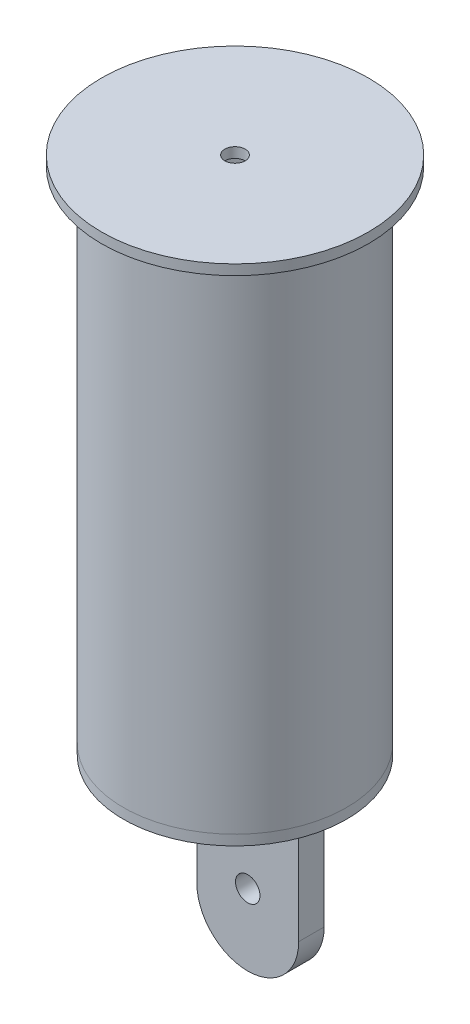
ISO-10303-21;
HEADER;
FILE_DESCRIPTION(('STEP AP214'),'2;1');
FILE_NAME('part.step','',(''),(''),'','','');
FILE_SCHEMA(('AUTOMOTIVE_DESIGN { 1 0 10303 214 1 1 1 1 }'));
ENDSEC;
DATA;
#1=APPLICATION_CONTEXT('core data for automotive mechanical design processes');
#2=APPLICATION_PROTOCOL_DEFINITION('international standard','automotive_design',2000,#1);
#3=PRODUCT_CONTEXT('',#1,'mechanical');
#4=PRODUCT('Part','Part','',(#3));
#5=PRODUCT_RELATED_PRODUCT_CATEGORY('part','',(#4));
#6=PRODUCT_DEFINITION_FORMATION('','',#4);
#7=PRODUCT_DEFINITION_CONTEXT('part definition',#1,'design');
#8=PRODUCT_DEFINITION('design','',#6,#7);
#9=PRODUCT_DEFINITION_SHAPE('','',#8);
#10=(LENGTH_UNIT() NAMED_UNIT(*) SI_UNIT(.MILLI.,.METRE.));
#11=(NAMED_UNIT(*) PLANE_ANGLE_UNIT() SI_UNIT($,.RADIAN.));
#12=(NAMED_UNIT(*) SI_UNIT($,.STERADIAN.) SOLID_ANGLE_UNIT());
#13=UNCERTAINTY_MEASURE_WITH_UNIT(LENGTH_MEASURE(1.E-05),#10,'distance_accuracy_value','');
#14=(GEOMETRIC_REPRESENTATION_CONTEXT(3) GLOBAL_UNCERTAINTY_ASSIGNED_CONTEXT((#13)) GLOBAL_UNIT_ASSIGNED_CONTEXT((#10,
#11,#12)) REPRESENTATION_CONTEXT('',''));
#15=CARTESIAN_POINT('',(0.,0.,0.));
#16=DIRECTION('',(0.,0.,1.));
#17=DIRECTION('',(1.,0.,0.));
#18=AXIS2_PLACEMENT_3D('',#15,#16,#17);
#19=CARTESIAN_POINT('',(0.,-10.,0.));
#20=DIRECTION('',(0.,-1.,0.));
#21=DIRECTION('',(0.,0.,-1.));
#22=AXIS2_PLACEMENT_3D('',#19,#20,#21);
#23=PLANE('',#22);
#24=CARTESIAN_POINT('',(0.,-10.,0.));
#25=DIRECTION('',(0.,-1.,0.));
#26=DIRECTION('',(0.,0.,-1.));
#27=AXIS2_PLACEMENT_3D('',#24,#25,#26);
#28=CIRCLE('',#27,109.54);
#29=CARTESIAN_POINT('',(0.,-10.,-109.54));
#30=VERTEX_POINT('',#29);
#31=EDGE_CURVE('E14',#30,#30,#28,.T.);
#32=ORIENTED_EDGE('',*,*,#31,.T.);
#33=EDGE_LOOP('',(#32));
#34=FACE_BOUND('',#33,.T.);
#35=DIRECTION('',(0.,0.,1.));
#36=VECTOR('',#35,1.);
#37=CARTESIAN_POINT('',(50.,-10.,-37.5));
#38=LINE('',#37,#36);
#39=CARTESIAN_POINT('',(50.,-10.,-37.5));
#40=VERTEX_POINT('',#39);
#41=CARTESIAN_POINT('',(50.,-10.,-12.5));
#42=VERTEX_POINT('',#41);
#43=EDGE_CURVE('E71',#40,#42,#38,.T.);
#44=ORIENTED_EDGE('',*,*,#43,.F.);
#45=DIRECTION('',(-1.,0.,0.));
#46=VECTOR('',#45,1.);
#47=CARTESIAN_POINT('',(-50.,-10.,-37.5));
#48=LINE('',#47,#46);
#49=CARTESIAN_POINT('',(-50.,-10.,-37.5));
#50=VERTEX_POINT('',#49);
#51=EDGE_CURVE('E75',#40,#50,#48,.T.);
#52=ORIENTED_EDGE('',*,*,#51,.T.);
#53=DIRECTION('',(0.,0.,1.));
#54=VECTOR('',#53,1.);
#55=CARTESIAN_POINT('',(-50.,-10.,-37.5));
#56=LINE('',#55,#54);
#57=CARTESIAN_POINT('',(-50.,-10.,-12.5));
#58=VERTEX_POINT('',#57);
#59=EDGE_CURVE('E107',#50,#58,#56,.T.);
#60=ORIENTED_EDGE('',*,*,#59,.T.);
#61=DIRECTION('',(-1.,0.,0.));
#62=VECTOR('',#61,1.);
#63=CARTESIAN_POINT('',(-50.,-10.,-12.5));
#64=LINE('',#63,#62);
#65=EDGE_CURVE('E123',#42,#58,#64,.T.);
#66=ORIENTED_EDGE('',*,*,#65,.F.);
#67=EDGE_LOOP('',(#44,#52,#60,#66));
#68=FACE_BOUND('',#67,.T.);
#69=ADVANCED_FACE('F56',(#34,#68),#23,.T.);
#70=CARTESIAN_POINT('',(0.,-10.,0.));
#71=DIRECTION('',(0.,1.,0.));
#72=DIRECTION('',(0.,0.,1.));
#73=AXIS2_PLACEMENT_3D('',#70,#71,#72);
#74=CYLINDRICAL_SURFACE('',#73,109.54);
#75=ORIENTED_EDGE('',*,*,#31,.F.);
#76=EDGE_LOOP('',(#75));
#77=FACE_BOUND('',#76,.T.);
#78=CARTESIAN_POINT('',(0.,0.,0.));
#79=DIRECTION('',(0.,-1.,0.));
#80=DIRECTION('',(0.,0.,-1.));
#81=AXIS2_PLACEMENT_3D('',#78,#79,#80);
#82=CIRCLE('',#81,109.54);
#83=CARTESIAN_POINT('',(0.,0.,-109.54));
#84=VERTEX_POINT('',#83);
#85=EDGE_CURVE('E60',#84,#84,#82,.T.);
#86=ORIENTED_EDGE('',*,*,#85,.T.);
#87=EDGE_LOOP('',(#86));
#88=FACE_BOUND('',#87,.T.);
#89=ADVANCED_FACE('F58',(#77,#88),#74,.T.);
#90=CARTESIAN_POINT('',(0.,0.,0.));
#91=DIRECTION('',(0.,-1.,0.));
#92=DIRECTION('',(0.,0.,-1.));
#93=AXIS2_PLACEMENT_3D('',#90,#91,#92);
#94=PLANE('',#93);
#95=ORIENTED_EDGE('',*,*,#85,.F.);
#96=EDGE_LOOP('',(#95));
#97=FACE_BOUND('',#96,.T.);
#98=ADVANCED_FACE('F140',(#97),#94,.F.);
#99=CARTESIAN_POINT('',(50.,-10.,-37.5));
#100=DIRECTION('',(1.,0.,0.));
#101=DIRECTION('',(0.,1.,0.));
#102=AXIS2_PLACEMENT_3D('',#99,#100,#101);
#103=PLANE('',#102);
#104=DIRECTION('',(0.,1.,0.));
#105=VECTOR('',#104,1.);
#106=CARTESIAN_POINT('',(50.,-10.,-12.5));
#107=LINE('',#106,#105);
#108=CARTESIAN_POINT('',(50.,-150.,-12.5));
#109=VERTEX_POINT('',#108);
#110=EDGE_CURVE('E118',#109,#42,#107,.T.);
#111=ORIENTED_EDGE('',*,*,#110,.F.);
#112=DIRECTION('',(0.,0.,1.));
#113=VECTOR('',#112,1.);
#114=CARTESIAN_POINT('',(50.,-150.,-37.5));
#115=LINE('',#114,#113);
#116=CARTESIAN_POINT('',(50.,-150.,-37.5));
#117=VERTEX_POINT('',#116);
#118=EDGE_CURVE('E106',#117,#109,#115,.T.);
#119=ORIENTED_EDGE('',*,*,#118,.F.);
#120=DIRECTION('',(0.,1.,0.));
#121=VECTOR('',#120,1.);
#122=CARTESIAN_POINT('',(50.,-10.,-37.5));
#123=LINE('',#122,#121);
#124=EDGE_CURVE('E114',#117,#40,#123,.T.);
#125=ORIENTED_EDGE('',*,*,#124,.T.);
#126=ORIENTED_EDGE('',*,*,#43,.T.);
#127=EDGE_LOOP('',(#111,#119,#125,#126));
#128=FACE_BOUND('',#127,.T.);
#129=ADVANCED_FACE('F138',(#128),#103,.T.);
#130=CARTESIAN_POINT('',(0.,-150.,-37.5));
#131=DIRECTION('',(0.,0.,1.));
#132=DIRECTION('',(1.,0.,0.));
#133=AXIS2_PLACEMENT_3D('',#130,#131,#132);
#134=CYLINDRICAL_SURFACE('',#133,50.);
#135=CARTESIAN_POINT('',(0.,-150.,-12.5));
#136=DIRECTION('',(0.,0.,1.));
#137=DIRECTION('',(1.,0.,0.));
#138=AXIS2_PLACEMENT_3D('',#135,#136,#137);
#139=CIRCLE('',#138,50.);
#140=CARTESIAN_POINT('',(-50.,-150.,-12.5));
#141=VERTEX_POINT('',#140);
#142=EDGE_CURVE('E101',#141,#109,#139,.T.);
#143=ORIENTED_EDGE('',*,*,#142,.F.);
#144=DIRECTION('',(0.,0.,1.));
#145=VECTOR('',#144,1.);
#146=CARTESIAN_POINT('',(-50.,-150.,-37.5));
#147=LINE('',#146,#145);
#148=CARTESIAN_POINT('',(-50.,-150.,-37.5));
#149=VERTEX_POINT('',#148);
#150=EDGE_CURVE('E95',#149,#141,#147,.T.);
#151=ORIENTED_EDGE('',*,*,#150,.F.);
#152=CARTESIAN_POINT('',(0.,-150.,-37.5));
#153=DIRECTION('',(0.,0.,1.));
#154=DIRECTION('',(1.,0.,0.));
#155=AXIS2_PLACEMENT_3D('',#152,#153,#154);
#156=CIRCLE('',#155,50.);
#157=EDGE_CURVE('E98',#149,#117,#156,.T.);
#158=ORIENTED_EDGE('',*,*,#157,.T.);
#159=ORIENTED_EDGE('',*,*,#118,.T.);
#160=EDGE_LOOP('',(#143,#151,#158,#159));
#161=FACE_BOUND('',#160,.T.);
#162=ADVANCED_FACE('F97',(#161),#134,.T.);
#163=CARTESIAN_POINT('',(-50.,-10.,-37.5));
#164=DIRECTION('',(-1.,0.,0.));
#165=DIRECTION('',(0.,-1.,0.));
#166=AXIS2_PLACEMENT_3D('',#163,#164,#165);
#167=PLANE('',#166);
#168=DIRECTION('',(0.,-1.,0.));
#169=VECTOR('',#168,1.);
#170=CARTESIAN_POINT('',(-50.,-10.,-12.5));
#171=LINE('',#170,#169);
#172=EDGE_CURVE('E126',#58,#141,#171,.T.);
#173=ORIENTED_EDGE('',*,*,#172,.F.);
#174=ORIENTED_EDGE('',*,*,#59,.F.);
#175=DIRECTION('',(0.,-1.,0.));
#176=VECTOR('',#175,1.);
#177=CARTESIAN_POINT('',(-50.,-10.,-37.5));
#178=LINE('',#177,#176);
#179=EDGE_CURVE('E112',#50,#149,#178,.T.);
#180=ORIENTED_EDGE('',*,*,#179,.T.);
#181=ORIENTED_EDGE('',*,*,#150,.T.);
#182=EDGE_LOOP('',(#173,#174,#180,#181));
#183=FACE_BOUND('',#182,.T.);
#184=ADVANCED_FACE('F116',(#183),#167,.T.);
#185=CARTESIAN_POINT('',(0.,-150.,-37.5));
#186=DIRECTION('',(0.,0.,1.));
#187=DIRECTION('',(1.,0.,0.));
#188=AXIS2_PLACEMENT_3D('',#185,#186,#187);
#189=PLANE('',#188);
#190=CARTESIAN_POINT('',(0.,-130.,-37.5));
#191=DIRECTION('',(0.,0.,1.));
#192=DIRECTION('',(1.,0.,0.));
#193=AXIS2_PLACEMENT_3D('',#190,#191,#192);
#194=CIRCLE('',#193,12.);
#195=CARTESIAN_POINT('',(12.,-130.,-37.5));
#196=VERTEX_POINT('',#195);
#197=EDGE_CURVE('E127',#196,#196,#194,.T.);
#198=ORIENTED_EDGE('',*,*,#197,.T.);
#199=EDGE_LOOP('',(#198));
#200=FACE_BOUND('',#199,.T.);
#201=ORIENTED_EDGE('',*,*,#51,.F.);
#202=ORIENTED_EDGE('',*,*,#124,.F.);
#203=ORIENTED_EDGE('',*,*,#157,.F.);
#204=ORIENTED_EDGE('',*,*,#179,.F.);
#205=EDGE_LOOP('',(#201,#202,#203,#204));
#206=FACE_BOUND('',#205,.T.);
#207=ADVANCED_FACE('F111',(#200,#206),#189,.F.);
#208=CARTESIAN_POINT('',(0.,-150.,-12.5));
#209=DIRECTION('',(0.,0.,1.));
#210=DIRECTION('',(1.,0.,0.));
#211=AXIS2_PLACEMENT_3D('',#208,#209,#210);
#212=PLANE('',#211);
#213=CARTESIAN_POINT('',(0.,-130.,-12.5));
#214=DIRECTION('',(0.,0.,1.));
#215=DIRECTION('',(1.,0.,0.));
#216=AXIS2_PLACEMENT_3D('',#213,#214,#215);
#217=CIRCLE('',#216,12.);
#218=CARTESIAN_POINT('',(12.,-130.,-12.5));
#219=VERTEX_POINT('',#218);
#220=EDGE_CURVE('E178',#219,#219,#217,.T.);
#221=ORIENTED_EDGE('',*,*,#220,.F.);
#222=EDGE_LOOP('',(#221));
#223=FACE_BOUND('',#222,.T.);
#224=ORIENTED_EDGE('',*,*,#65,.T.);
#225=ORIENTED_EDGE('',*,*,#172,.T.);
#226=ORIENTED_EDGE('',*,*,#142,.T.);
#227=ORIENTED_EDGE('',*,*,#110,.T.);
#228=EDGE_LOOP('',(#224,#225,#226,#227));
#229=FACE_BOUND('',#228,.T.);
#230=ADVANCED_FACE('F135',(#223,#229),#212,.T.);
#231=CARTESIAN_POINT('',(0.,-130.,-37.5));
#232=DIRECTION('',(0.,0.,1.));
#233=DIRECTION('',(1.,0.,0.));
#234=AXIS2_PLACEMENT_3D('',#231,#232,#233);
#235=CYLINDRICAL_SURFACE('',#234,12.);
#236=ORIENTED_EDGE('',*,*,#197,.F.);
#237=EDGE_LOOP('',(#236));
#238=FACE_BOUND('',#237,.T.);
#239=ORIENTED_EDGE('',*,*,#220,.T.);
#240=EDGE_LOOP('',(#239));
#241=FACE_BOUND('',#240,.T.);
#242=ADVANCED_FACE('F166',(#238,#241),#235,.F.);
#243=CLOSED_SHELL('',(#69,#89,#98,#129,#162,#184,#207,#230,#242));
#244=MANIFOLD_SOLID_BREP('B2',#243);
#245=CARTESIAN_POINT('',(0.,0.,0.));
#246=DIRECTION('',(0.,-1.,0.));
#247=DIRECTION('',(0.,0.,-1.));
#248=AXIS2_PLACEMENT_3D('',#245,#246,#247);
#249=CYLINDRICAL_SURFACE('',#248,10.);
#250=CARTESIAN_POINT('',(0.,490.,0.));
#251=DIRECTION('',(0.,-1.,0.));
#252=DIRECTION('',(0.,0.,-1.));
#253=AXIS2_PLACEMENT_3D('',#250,#251,#252);
#254=CIRCLE('',#253,10.);
#255=CARTESIAN_POINT('',(0.,490.,-10.));
#256=VERTEX_POINT('',#255);
#257=EDGE_CURVE('E246',#256,#256,#254,.T.);
#258=ORIENTED_EDGE('',*,*,#257,.T.);
#259=EDGE_LOOP('',(#258));
#260=FACE_BOUND('',#259,.T.);
#261=CARTESIAN_POINT('',(0.,500.,0.));
#262=DIRECTION('',(0.,-1.,0.));
#263=DIRECTION('',(0.,0.,-1.));
#264=AXIS2_PLACEMENT_3D('',#261,#262,#263);
#265=CIRCLE('',#264,10.);
#266=CARTESIAN_POINT('',(0.,500.,-10.));
#267=VERTEX_POINT('',#266);
#268=EDGE_CURVE('E55',#267,#267,#265,.T.);
#269=ORIENTED_EDGE('',*,*,#268,.F.);
#270=EDGE_LOOP('',(#269));
#271=FACE_BOUND('',#270,.T.);
#272=ADVANCED_FACE('F218',(#260,#271),#249,.F.);
#273=CARTESIAN_POINT('',(10.,500.,0.));
#274=DIRECTION('',(0.,1.,0.));
#275=DIRECTION('',(0.,0.,1.));
#276=AXIS2_PLACEMENT_3D('',#273,#274,#275);
#277=PLANE('',#276);
#278=ORIENTED_EDGE('',*,*,#268,.T.);
#279=EDGE_LOOP('',(#278));
#280=FACE_BOUND('',#279,.T.);
#281=CARTESIAN_POINT('',(0.,500.,0.));
#282=DIRECTION('',(0.,-1.,0.));
#283=DIRECTION('',(0.,0.,-1.));
#284=AXIS2_PLACEMENT_3D('',#281,#282,#283);
#285=CIRCLE('',#284,131.);
#286=CARTESIAN_POINT('',(0.,500.,-131.));
#287=VERTEX_POINT('',#286);
#288=EDGE_CURVE('E224',#287,#287,#285,.T.);
#289=ORIENTED_EDGE('',*,*,#288,.F.);
#290=EDGE_LOOP('',(#289));
#291=FACE_BOUND('',#290,.T.);
#292=ADVANCED_FACE('F264',(#280,#291),#277,.T.);
#293=CARTESIAN_POINT('',(0.,0.,0.));
#294=DIRECTION('',(0.,-1.,0.));
#295=DIRECTION('',(0.,0.,-1.));
#296=AXIS2_PLACEMENT_3D('',#293,#294,#295);
#297=CYLINDRICAL_SURFACE('',#296,131.);
#298=ORIENTED_EDGE('',*,*,#288,.T.);
#299=EDGE_LOOP('',(#298));
#300=FACE_BOUND('',#299,.T.);
#301=CARTESIAN_POINT('',(0.,490.,0.));
#302=DIRECTION('',(0.,-1.,0.));
#303=DIRECTION('',(0.,0.,-1.));
#304=AXIS2_PLACEMENT_3D('',#301,#302,#303);
#305=CIRCLE('',#304,131.);
#306=CARTESIAN_POINT('',(0.,490.,-131.));
#307=VERTEX_POINT('',#306);
#308=EDGE_CURVE('E228',#307,#307,#305,.T.);
#309=ORIENTED_EDGE('',*,*,#308,.F.);
#310=EDGE_LOOP('',(#309));
#311=FACE_BOUND('',#310,.T.);
#312=ADVANCED_FACE('F268',(#300,#311),#297,.T.);
#313=CARTESIAN_POINT('',(131.,490.,0.));
#314=DIRECTION('',(0.,-1.,0.));
#315=DIRECTION('',(0.,0.,-1.));
#316=AXIS2_PLACEMENT_3D('',#313,#314,#315);
#317=PLANE('',#316);
#318=ORIENTED_EDGE('',*,*,#308,.T.);
#319=EDGE_LOOP('',(#318));
#320=FACE_BOUND('',#319,.T.);
#321=CARTESIAN_POINT('',(0.,490.,0.));
#322=DIRECTION('',(0.,-1.,0.));
#323=DIRECTION('',(0.,0.,-1.));
#324=AXIS2_PLACEMENT_3D('',#321,#322,#323);
#325=CIRCLE('',#324,109.54);
#326=CARTESIAN_POINT('',(0.,490.,-109.54));
#327=VERTEX_POINT('',#326);
#328=EDGE_CURVE('E232',#327,#327,#325,.T.);
#329=ORIENTED_EDGE('',*,*,#328,.F.);
#330=EDGE_LOOP('',(#329));
#331=FACE_BOUND('',#330,.T.);
#332=ADVANCED_FACE('F272',(#320,#331),#317,.T.);
#333=CARTESIAN_POINT('',(0.,0.,0.));
#334=DIRECTION('',(0.,-1.,0.));
#335=DIRECTION('',(0.,0.,-1.));
#336=AXIS2_PLACEMENT_3D('',#333,#334,#335);
#337=CYLINDRICAL_SURFACE('',#336,109.54);
#338=ORIENTED_EDGE('',*,*,#328,.T.);
#339=EDGE_LOOP('',(#338));
#340=FACE_BOUND('',#339,.T.);
#341=CARTESIAN_POINT('',(0.,0.,0.));
#342=DIRECTION('',(0.,-1.,0.));
#343=DIRECTION('',(0.,0.,-1.));
#344=AXIS2_PLACEMENT_3D('',#341,#342,#343);
#345=CIRCLE('',#344,109.54);
#346=CARTESIAN_POINT('',(0.,0.,-109.54));
#347=VERTEX_POINT('',#346);
#348=EDGE_CURVE('E237',#347,#347,#345,.T.);
#349=ORIENTED_EDGE('',*,*,#348,.F.);
#350=EDGE_LOOP('',(#349));
#351=FACE_BOUND('',#350,.T.);
#352=ADVANCED_FACE('F278',(#340,#351),#337,.T.);
#353=CARTESIAN_POINT('',(103.54,0.,0.));
#354=DIRECTION('',(0.,-1.,0.));
#355=DIRECTION('',(0.,0.,-1.));
#356=AXIS2_PLACEMENT_3D('',#353,#354,#355);
#357=PLANE('',#356);
#358=ORIENTED_EDGE('',*,*,#348,.T.);
#359=EDGE_LOOP('',(#358));
#360=FACE_BOUND('',#359,.T.);
#361=CARTESIAN_POINT('',(0.,0.,0.));
#362=DIRECTION('',(0.,-1.,0.));
#363=DIRECTION('',(0.,0.,-1.));
#364=AXIS2_PLACEMENT_3D('',#361,#362,#363);
#365=CIRCLE('',#364,103.54);
#366=CARTESIAN_POINT('',(0.,0.,-103.54));
#367=VERTEX_POINT('',#366);
#368=EDGE_CURVE('E240',#367,#367,#365,.T.);
#369=ORIENTED_EDGE('',*,*,#368,.F.);
#370=EDGE_LOOP('',(#369));
#371=FACE_BOUND('',#370,.T.);
#372=ADVANCED_FACE('F260',(#360,#371),#357,.T.);
#373=CARTESIAN_POINT('',(0.,0.,0.));
#374=DIRECTION('',(0.,-1.,0.));
#375=DIRECTION('',(0.,0.,-1.));
#376=AXIS2_PLACEMENT_3D('',#373,#374,#375);
#377=CYLINDRICAL_SURFACE('',#376,103.54);
#378=ORIENTED_EDGE('',*,*,#368,.T.);
#379=EDGE_LOOP('',(#378));
#380=FACE_BOUND('',#379,.T.);
#381=CARTESIAN_POINT('',(0.,490.,0.));
#382=DIRECTION('',(0.,-1.,0.));
#383=DIRECTION('',(0.,0.,-1.));
#384=AXIS2_PLACEMENT_3D('',#381,#382,#383);
#385=CIRCLE('',#384,103.54);
#386=CARTESIAN_POINT('',(0.,490.,-103.54));
#387=VERTEX_POINT('',#386);
#388=EDGE_CURVE('E243',#387,#387,#385,.T.);
#389=ORIENTED_EDGE('',*,*,#388,.F.);
#390=EDGE_LOOP('',(#389));
#391=FACE_BOUND('',#390,.T.);
#392=ADVANCED_FACE('F254',(#380,#391),#377,.F.);
#393=CARTESIAN_POINT('',(103.54,490.,0.));
#394=DIRECTION('',(0.,-1.,0.));
#395=DIRECTION('',(0.,0.,-1.));
#396=AXIS2_PLACEMENT_3D('',#393,#394,#395);
#397=PLANE('',#396);
#398=ORIENTED_EDGE('',*,*,#388,.T.);
#399=EDGE_LOOP('',(#398));
#400=FACE_BOUND('',#399,.T.);
#401=ORIENTED_EDGE('',*,*,#257,.F.);
#402=EDGE_LOOP('',(#401));
#403=FACE_BOUND('',#402,.T.);
#404=ADVANCED_FACE('F252',(#400,#403),#397,.T.);
#405=CLOSED_SHELL('',(#272,#292,#312,#332,#352,#372,#392,#404));
#406=MANIFOLD_SOLID_BREP('B8',#405);
#407=ADVANCED_BREP_SHAPE_REPRESENTATION('',(#18,#244,#406),#14);
#408=SHAPE_DEFINITION_REPRESENTATION(#9,#407);
ENDSEC;
END-ISO-10303-21;
